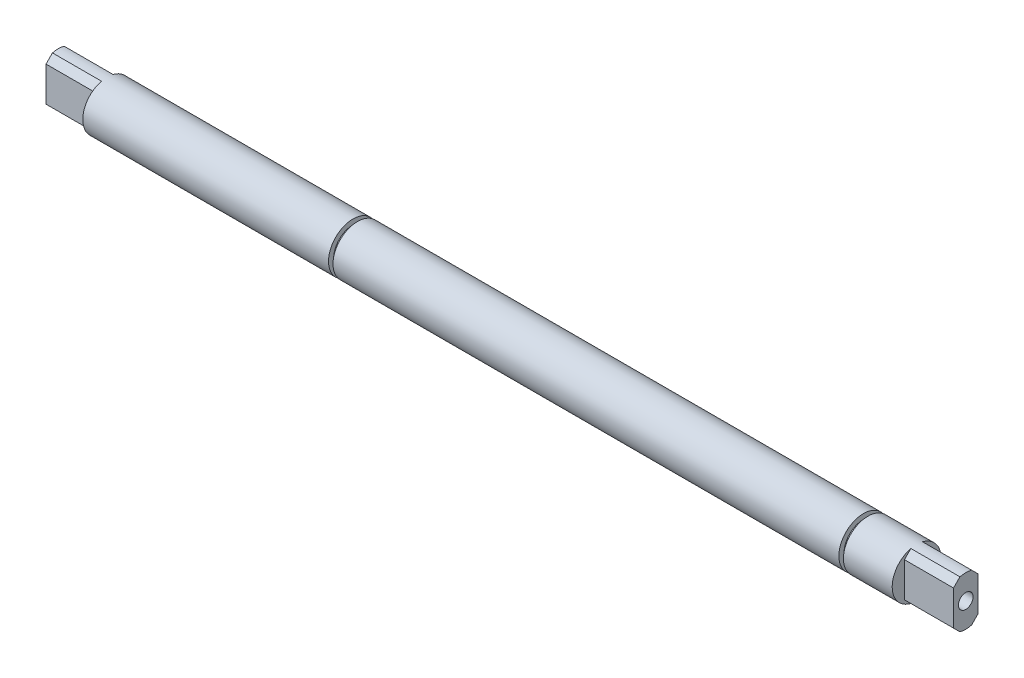
ISO-10303-21;
HEADER;
FILE_DESCRIPTION(('STEP AP214'),'2;1');
FILE_NAME('part.step','',(''),(''),'','','');
FILE_SCHEMA(('AUTOMOTIVE_DESIGN { 1 0 10303 214 1 1 1 1 }'));
ENDSEC;
DATA;
#1=APPLICATION_CONTEXT('core data for automotive mechanical design processes');
#2=APPLICATION_PROTOCOL_DEFINITION('international standard','automotive_design',2000,#1);
#3=PRODUCT_CONTEXT('',#1,'mechanical');
#4=PRODUCT('Part','Part','',(#3));
#5=PRODUCT_RELATED_PRODUCT_CATEGORY('part','',(#4));
#6=PRODUCT_DEFINITION_FORMATION('','',#4);
#7=PRODUCT_DEFINITION_CONTEXT('part definition',#1,'design');
#8=PRODUCT_DEFINITION('design','',#6,#7);
#9=PRODUCT_DEFINITION_SHAPE('','',#8);
#10=(LENGTH_UNIT() NAMED_UNIT(*) SI_UNIT(.MILLI.,.METRE.));
#11=(NAMED_UNIT(*) PLANE_ANGLE_UNIT() SI_UNIT($,.RADIAN.));
#12=(NAMED_UNIT(*) SI_UNIT($,.STERADIAN.) SOLID_ANGLE_UNIT());
#13=UNCERTAINTY_MEASURE_WITH_UNIT(LENGTH_MEASURE(1.E-05),#10,'distance_accuracy_value','');
#14=(GEOMETRIC_REPRESENTATION_CONTEXT(3) GLOBAL_UNCERTAINTY_ASSIGNED_CONTEXT((#13)) GLOBAL_UNIT_ASSIGNED_CONTEXT((#10,
#11,#12)) REPRESENTATION_CONTEXT('',''));
#15=CARTESIAN_POINT('',(0.,0.,0.));
#16=DIRECTION('',(0.,0.,1.));
#17=DIRECTION('',(1.,0.,0.));
#18=AXIS2_PLACEMENT_3D('',#15,#16,#17);
#19=CARTESIAN_POINT('',(117.5,0.,0.));
#20=DIRECTION('',(-1.,0.,0.));
#21=DIRECTION('',(0.,0.,1.));
#22=AXIS2_PLACEMENT_3D('',#19,#20,#21);
#23=CYLINDRICAL_SURFACE('',#22,6.35);
#24=CARTESIAN_POINT('',(-40.,0.,0.));
#25=DIRECTION('',(1.,0.,0.));
#26=DIRECTION('',(0.,0.,-1.));
#27=AXIS2_PLACEMENT_3D('',#24,#25,#26);
#28=CIRCLE('',#27,6.35);
#29=CARTESIAN_POINT('',(-40.,0.,6.35));
#30=VERTEX_POINT('',#29);
#31=EDGE_CURVE('E655',#30,#30,#28,.T.);
#32=CARTESIAN_POINT('',(91.,0.,0.));
#33=DIRECTION('',(1.,0.,0.));
#34=DIRECTION('',(0.,0.,-1.));
#35=AXIS2_PLACEMENT_3D('',#32,#33,#34);
#36=CIRCLE('',#35,6.35);
#37=CARTESIAN_POINT('',(91.,0.,6.35));
#38=VERTEX_POINT('',#37);
#39=EDGE_CURVE('E362',#38,#38,#36,.T.);
#40=CARTESIAN_POINT('',(-40.,0.,6.35));
#41=CARTESIAN_POINT('',(-38.6354166666667,0.,6.35));
#42=CARTESIAN_POINT('',(-37.2708333333333,0.,6.35));
#43=CARTESIAN_POINT('',(-34.5416666666667,0.,6.35));
#44=CARTESIAN_POINT('',(-33.1770833333333,0.,6.35));
#45=CARTESIAN_POINT('',(-30.4479166666667,0.,6.35));
#46=CARTESIAN_POINT('',(-29.0833333333333,0.,6.35));
#47=CARTESIAN_POINT('',(-26.3541666666667,0.,6.35));
#48=CARTESIAN_POINT('',(-24.9895833333333,0.,6.35));
#49=CARTESIAN_POINT('',(-22.2604166666667,0.,6.35));
#50=CARTESIAN_POINT('',(-20.8958333333333,0.,6.35));
#51=CARTESIAN_POINT('',(-18.1666666666667,0.,6.35));
#52=CARTESIAN_POINT('',(-16.8020833333333,0.,6.35));
#53=CARTESIAN_POINT('',(-14.0729166666667,0.,6.35));
#54=CARTESIAN_POINT('',(-12.7083333333333,0.,6.35));
#55=CARTESIAN_POINT('',(-9.97916666666668,0.,6.35));
#56=CARTESIAN_POINT('',(-8.61458333333335,0.,6.35));
#57=CARTESIAN_POINT('',(-5.88541666666668,0.,6.35));
#58=CARTESIAN_POINT('',(-4.52083333333335,0.,6.35));
#59=CARTESIAN_POINT('',(-1.79166666666668,0.,6.35));
#60=CARTESIAN_POINT('',(-0.427083333333351,0.,6.35));
#61=CARTESIAN_POINT('',(2.30208333333331,0.,6.35));
#62=CARTESIAN_POINT('',(3.66666666666664,0.,6.35));
#63=CARTESIAN_POINT('',(6.39583333333331,0.,6.35));
#64=CARTESIAN_POINT('',(7.76041666666664,0.,6.35));
#65=CARTESIAN_POINT('',(10.4895833333333,0.,6.35));
#66=CARTESIAN_POINT('',(11.8541666666667,0.,6.35));
#67=CARTESIAN_POINT('',(14.5833333333333,0.,6.35));
#68=CARTESIAN_POINT('',(15.9479166666666,0.,6.35));
#69=CARTESIAN_POINT('',(18.6770833333333,0.,6.35));
#70=CARTESIAN_POINT('',(20.0416666666666,0.,6.35));
#71=CARTESIAN_POINT('',(22.7708333333333,0.,6.35));
#72=CARTESIAN_POINT('',(24.1354166666666,0.,6.35));
#73=CARTESIAN_POINT('',(26.8645833333333,0.,6.35));
#74=CARTESIAN_POINT('',(28.2291666666667,0.,6.35));
#75=CARTESIAN_POINT('',(30.9583333333333,0.,6.35));
#76=CARTESIAN_POINT('',(32.3229166666667,0.,6.35));
#77=CARTESIAN_POINT('',(35.0520833333333,0.,6.35));
#78=CARTESIAN_POINT('',(36.4166666666666,0.,6.35));
#79=CARTESIAN_POINT('',(39.1458333333333,0.,6.35));
#80=CARTESIAN_POINT('',(40.5104166666666,0.,6.35));
#81=CARTESIAN_POINT('',(43.2395833333333,0.,6.35));
#82=CARTESIAN_POINT('',(44.6041666666667,0.,6.35));
#83=CARTESIAN_POINT('',(47.3333333333333,0.,6.35));
#84=CARTESIAN_POINT('',(48.6979166666667,0.,6.35));
#85=CARTESIAN_POINT('',(51.4270833333333,0.,6.35));
#86=CARTESIAN_POINT('',(52.7916666666666,0.,6.35));
#87=CARTESIAN_POINT('',(55.5208333333333,0.,6.35));
#88=CARTESIAN_POINT('',(56.8854166666666,0.,6.35));
#89=CARTESIAN_POINT('',(59.6145833333333,0.,6.35));
#90=CARTESIAN_POINT('',(60.9791666666667,0.,6.35));
#91=CARTESIAN_POINT('',(63.7083333333333,0.,6.35));
#92=CARTESIAN_POINT('',(65.0729166666666,0.,6.35));
#93=CARTESIAN_POINT('',(67.8020833333333,0.,6.35));
#94=CARTESIAN_POINT('',(69.1666666666666,0.,6.35));
#95=CARTESIAN_POINT('',(71.8958333333333,0.,6.35));
#96=CARTESIAN_POINT('',(73.2604166666666,0.,6.35));
#97=CARTESIAN_POINT('',(75.9895833333333,0.,6.35));
#98=CARTESIAN_POINT('',(77.3541666666666,0.,6.35));
#99=CARTESIAN_POINT('',(80.0833333333333,0.,6.35));
#100=CARTESIAN_POINT('',(81.4479166666666,0.,6.35));
#101=CARTESIAN_POINT('',(84.1770833333333,0.,6.35));
#102=CARTESIAN_POINT('',(85.5416666666666,0.,6.35));
#103=CARTESIAN_POINT('',(88.2708333333333,0.,6.35));
#104=CARTESIAN_POINT('',(89.6354166666666,0.,6.35));
#105=CARTESIAN_POINT('',(91.,0.,6.35));
#106=B_SPLINE_CURVE_WITH_KNOTS('',3,(#40,#41,#42,#43,#44,#45,#46,#47,#48,#49,#50,#51,#52,#53,
#54,#55,#56,#57,#58,#59,#60,#61,#62,#63,#64,#65,#66,#67,#68,#69,#70,#71,#72,#73,#74,#75,#76,#77,
#78,#79,#80,#81,#82,#83,#84,#85,#86,#87,#88,#89,#90,#91,#92,#93,#94,#95,#96,#97,#98,#99,#100,
#101,#102,#103,#104,#105),.UNSPECIFIED.,.F.,.F.,(4,2,2,2,2,2,2,2,2,2,2,2,2,2,2,2,2,2,2,2,2,2,2,
2,2,2,2,2,2,2,2,2,4),(0.,4.09375000000001,8.18750000000001,12.28125,16.375,20.46875,24.5625,
28.65625,32.75,36.84375,40.9375,45.03125,49.125,53.21875,57.3125,61.40625,65.5,69.59375,73.6875,
77.78125,81.875,85.96875,90.0625,94.15625,98.25,102.34375,106.4375,110.53125,114.625,118.71875,
122.8125,126.90625,131.),.UNSPECIFIED.);
#107=EDGE_CURVE('BSEAM36',#30,#38,#106,.T.);
#108=ORIENTED_EDGE('',*,*,#31,.T.);
#109=ORIENTED_EDGE('',*,*,#39,.F.);
#110=ORIENTED_EDGE('',*,*,#107,.T.);
#111=ORIENTED_EDGE('',*,*,#107,.F.);
#112=EDGE_LOOP('',(#108,#110,#109,#111));
#113=FACE_BOUND('',#112,.T.);
#114=ADVANCED_FACE('F36',(#113),#23,.T.);
#115=CARTESIAN_POINT('',(91.,0.,-6.35));
#116=DIRECTION('',(-1.,0.,0.));
#117=DIRECTION('',(0.,0.,1.));
#118=AXIS2_PLACEMENT_3D('',#115,#116,#117);
#119=PLANE('',#118);
#120=CARTESIAN_POINT('',(91.,0.,0.));
#121=DIRECTION('',(1.,0.,0.));
#122=DIRECTION('',(0.,0.,-1.));
#123=AXIS2_PLACEMENT_3D('',#120,#121,#122);
#124=CIRCLE('',#123,5.0292);
#125=CARTESIAN_POINT('',(91.,0.,-5.0292));
#126=VERTEX_POINT('',#125);
#127=EDGE_CURVE('E169',#126,#126,#124,.T.);
#128=ORIENTED_EDGE('',*,*,#127,.F.);
#129=EDGE_LOOP('',(#128));
#130=FACE_BOUND('',#129,.T.);
#131=ORIENTED_EDGE('',*,*,#39,.T.);
#132=EDGE_LOOP('',(#131));
#133=FACE_BOUND('',#132,.T.);
#134=ADVANCED_FACE('F329',(#130,#133),#119,.F.);
#135=CARTESIAN_POINT('',(0.,0.,0.));
#136=DIRECTION('',(1.,0.,0.));
#137=DIRECTION('',(0.,0.,-1.));
#138=AXIS2_PLACEMENT_3D('',#135,#136,#137);
#139=CYLINDRICAL_SURFACE('',#138,5.0292);
#140=CARTESIAN_POINT('',(92.1684,0.,0.));
#141=DIRECTION('',(1.,0.,0.));
#142=DIRECTION('',(0.,0.,-1.));
#143=AXIS2_PLACEMENT_3D('',#140,#141,#142);
#144=CIRCLE('',#143,5.0292);
#145=CARTESIAN_POINT('',(92.1684,0.,-5.0292));
#146=VERTEX_POINT('',#145);
#147=EDGE_CURVE('E361',#146,#146,#144,.T.);
#148=ORIENTED_EDGE('',*,*,#147,.F.);
#149=EDGE_LOOP('',(#148));
#150=FACE_BOUND('',#149,.T.);
#151=ORIENTED_EDGE('',*,*,#127,.T.);
#152=EDGE_LOOP('',(#151));
#153=FACE_BOUND('',#152,.T.);
#154=ADVANCED_FACE('F336',(#150,#153),#139,.T.);
#155=CARTESIAN_POINT('',(92.1684,0.,-5.0292));
#156=DIRECTION('',(1.,0.,0.));
#157=DIRECTION('',(0.,0.,-1.));
#158=AXIS2_PLACEMENT_3D('',#155,#156,#157);
#159=PLANE('',#158);
#160=CARTESIAN_POINT('',(92.1684,0.,0.));
#161=DIRECTION('',(1.,0.,0.));
#162=DIRECTION('',(0.,0.,-1.));
#163=AXIS2_PLACEMENT_3D('',#160,#161,#162);
#164=CIRCLE('',#163,6.35);
#165=CARTESIAN_POINT('',(92.1684,0.,-6.35));
#166=VERTEX_POINT('',#165);
#167=EDGE_CURVE('E359',#166,#166,#164,.T.);
#168=ORIENTED_EDGE('',*,*,#167,.F.);
#169=EDGE_LOOP('',(#168));
#170=FACE_BOUND('',#169,.T.);
#171=ORIENTED_EDGE('',*,*,#147,.T.);
#172=EDGE_LOOP('',(#171));
#173=FACE_BOUND('',#172,.T.);
#174=ADVANCED_FACE('F156',(#170,#173),#159,.F.);
#175=CARTESIAN_POINT('',(102.55,0.,0.));
#176=DIRECTION('',(1.,0.,0.));
#177=DIRECTION('',(0.,0.,-1.));
#178=AXIS2_PLACEMENT_3D('',#175,#176,#177);
#179=CONICAL_SURFACE('',#178,1.89864999999999,1.02974425867665);
#180=CARTESIAN_POINT('',(101.409175985683,0.,0.));
#181=VERTEX_POINT('',#180);
#182=VERTEX_LOOP('',#181);
#183=FACE_BOUND('',#182,.T.);
#184=CARTESIAN_POINT('',(102.55,0.,0.));
#185=DIRECTION('',(1.,0.,0.));
#186=DIRECTION('',(0.,0.,-1.));
#187=AXIS2_PLACEMENT_3D('',#184,#185,#186);
#188=CIRCLE('',#187,1.89864999999999);
#189=CARTESIAN_POINT('',(102.55,0.,-1.89864999999999));
#190=VERTEX_POINT('',#189);
#191=EDGE_CURVE('E160',#190,#190,#188,.T.);
#192=ORIENTED_EDGE('',*,*,#191,.T.);
#193=EDGE_LOOP('',(#192));
#194=FACE_BOUND('',#193,.T.);
#195=ADVANCED_FACE('F152',(#183,#194),#179,.F.);
#196=CARTESIAN_POINT('',(104.8,5.49926131403118,-3.175));
#197=DIRECTION('',(0.,0.,-1.));
#198=DIRECTION('',(-1.,0.,0.));
#199=AXIS2_PLACEMENT_3D('',#196,#197,#198);
#200=PLANE('',#199);
#201=DIRECTION('',(0.,1.,0.));
#202=VECTOR('',#201,1.);
#203=CARTESIAN_POINT('',(117.5,5.49926131403118,-3.175));
#204=LINE('',#203,#202);
#205=CARTESIAN_POINT('',(117.5,-4.49926131403115,-3.175));
#206=VERTEX_POINT('',#205);
#207=CARTESIAN_POINT('',(117.5,4.49926131403114,-3.175));
#208=VERTEX_POINT('',#207);
#209=EDGE_CURVE('E181',#206,#208,#204,.T.);
#210=ORIENTED_EDGE('',*,*,#209,.F.);
#211=DIRECTION('',(-1.,0.,0.));
#212=VECTOR('',#211,1.);
#213=CARTESIAN_POINT('',(104.8,-4.49926131403114,-3.175));
#214=LINE('',#213,#212);
#215=CARTESIAN_POINT('',(104.8,-4.49926131403114,-3.175));
#216=VERTEX_POINT('',#215);
#217=EDGE_CURVE('E56',#206,#216,#214,.T.);
#218=ORIENTED_EDGE('',*,*,#217,.T.);
#219=DIRECTION('',(0.,1.,0.));
#220=VECTOR('',#219,1.);
#221=CARTESIAN_POINT('',(104.8,5.49926131403118,-3.175));
#222=LINE('',#221,#220);
#223=CARTESIAN_POINT('',(104.8,4.49926131403114,-3.175));
#224=VERTEX_POINT('',#223);
#225=EDGE_CURVE('E186',#216,#224,#222,.T.);
#226=ORIENTED_EDGE('',*,*,#225,.T.);
#227=DIRECTION('',(1.,0.,0.));
#228=VECTOR('',#227,1.);
#229=CARTESIAN_POINT('',(117.5,4.49926131403114,-3.175));
#230=LINE('',#229,#228);
#231=EDGE_CURVE('E279',#224,#208,#230,.T.);
#232=ORIENTED_EDGE('',*,*,#231,.T.);
#233=EDGE_LOOP('',(#210,#218,#226,#232));
#234=FACE_BOUND('',#233,.T.);
#235=ADVANCED_FACE('F155',(#234),#200,.T.);
#236=CARTESIAN_POINT('',(117.5,0.,0.));
#237=DIRECTION('',(1.,0.,0.));
#238=DIRECTION('',(0.,0.,-1.));
#239=AXIS2_PLACEMENT_3D('',#236,#237,#238);
#240=CYLINDRICAL_SURFACE('',#239,1.89864999999999);
#241=ORIENTED_EDGE('',*,*,#191,.F.);
#242=EDGE_LOOP('',(#241));
#243=FACE_BOUND('',#242,.T.);
#244=CARTESIAN_POINT('',(117.5,0.,0.));
#245=DIRECTION('',(1.,0.,0.));
#246=DIRECTION('',(0.,0.,-1.));
#247=AXIS2_PLACEMENT_3D('',#244,#245,#246);
#248=CIRCLE('',#247,1.89864999999999);
#249=CARTESIAN_POINT('',(117.5,0.,-1.89864999999999));
#250=VERTEX_POINT('',#249);
#251=EDGE_CURVE('E163',#250,#250,#248,.T.);
#252=ORIENTED_EDGE('',*,*,#251,.T.);
#253=EDGE_LOOP('',(#252));
#254=FACE_BOUND('',#253,.T.);
#255=ADVANCED_FACE('F320',(#243,#254),#240,.F.);
#256=CARTESIAN_POINT('',(104.8,5.49926131403118,3.175));
#257=DIRECTION('',(0.,0.,1.));
#258=DIRECTION('',(1.,0.,0.));
#259=AXIS2_PLACEMENT_3D('',#256,#257,#258);
#260=PLANE('',#259);
#261=DIRECTION('',(0.,-1.,0.));
#262=VECTOR('',#261,1.);
#263=CARTESIAN_POINT('',(117.5,5.49926131403118,3.175));
#264=LINE('',#263,#262);
#265=CARTESIAN_POINT('',(117.5,4.49926131403115,3.175));
#266=VERTEX_POINT('',#265);
#267=CARTESIAN_POINT('',(117.5,-4.49926131403114,3.175));
#268=VERTEX_POINT('',#267);
#269=EDGE_CURVE('E175',#266,#268,#264,.T.);
#270=ORIENTED_EDGE('',*,*,#269,.F.);
#271=DIRECTION('',(-1.,0.,0.));
#272=VECTOR('',#271,1.);
#273=CARTESIAN_POINT('',(104.8,4.49926131403114,3.175));
#274=LINE('',#273,#272);
#275=CARTESIAN_POINT('',(104.8,4.49926131403114,3.175));
#276=VERTEX_POINT('',#275);
#277=EDGE_CURVE('E277',#266,#276,#274,.T.);
#278=ORIENTED_EDGE('',*,*,#277,.T.);
#279=DIRECTION('',(0.,-1.,0.));
#280=VECTOR('',#279,1.);
#281=CARTESIAN_POINT('',(104.8,5.49926131403118,3.175));
#282=LINE('',#281,#280);
#283=CARTESIAN_POINT('',(104.8,-4.49926131403114,3.175));
#284=VERTEX_POINT('',#283);
#285=EDGE_CURVE('E178',#276,#284,#282,.T.);
#286=ORIENTED_EDGE('',*,*,#285,.T.);
#287=DIRECTION('',(1.,0.,0.));
#288=VECTOR('',#287,1.);
#289=CARTESIAN_POINT('',(117.5,-4.49926131403114,3.175));
#290=LINE('',#289,#288);
#291=EDGE_CURVE('E274',#284,#268,#290,.T.);
#292=ORIENTED_EDGE('',*,*,#291,.T.);
#293=EDGE_LOOP('',(#270,#278,#286,#292));
#294=FACE_BOUND('',#293,.T.);
#295=ADVANCED_FACE('F306',(#294),#260,.T.);
#296=CARTESIAN_POINT('',(117.5,-4.49926131403114,3.175));
#297=DIRECTION('',(0.,-0.707106781186553,0.707106781186542));
#298=DIRECTION('',(-1.,0.,0.));
#299=AXIS2_PLACEMENT_3D('',#296,#297,#298);
#300=PLANE('',#299);
#301=DIRECTION('',(0.,0.707106781186542,0.707106781186553));
#302=VECTOR('',#301,1.);
#303=CARTESIAN_POINT('',(104.8,-4.49926131403114,3.175));
#304=LINE('',#303,#302);
#305=CARTESIAN_POINT('',(104.8,-6.16901365600829,1.50524765802282));
#306=VERTEX_POINT('',#305);
#307=EDGE_CURVE('E286',#306,#284,#304,.T.);
#308=ORIENTED_EDGE('',*,*,#307,.F.);
#309=DIRECTION('',(-1.,0.,0.));
#310=VECTOR('',#309,1.);
#311=CARTESIAN_POINT('',(117.5,-6.16901365600829,1.50524765802282));
#312=LINE('',#311,#310);
#313=CARTESIAN_POINT('',(117.5,-6.16901365600829,1.50524765802282));
#314=VERTEX_POINT('',#313);
#315=EDGE_CURVE('E260',#314,#306,#312,.T.);
#316=ORIENTED_EDGE('',*,*,#315,.F.);
#317=DIRECTION('',(0.,-0.707106781186542,-0.707106781186553));
#318=VECTOR('',#317,1.);
#319=CARTESIAN_POINT('',(117.5,-3.8371306570156,3.83713065701555));
#320=LINE('',#319,#318);
#321=EDGE_CURVE('E270',#268,#314,#320,.T.);
#322=ORIENTED_EDGE('',*,*,#321,.F.);
#323=ORIENTED_EDGE('',*,*,#291,.F.);
#324=EDGE_LOOP('',(#308,#316,#322,#323));
#325=FACE_BOUND('',#324,.T.);
#326=ADVANCED_FACE('F304',(#325),#300,.T.);
#327=CARTESIAN_POINT('',(117.5,-6.16901365600829,-1.50524765802282));
#328=DIRECTION('',(0.,-0.707106781186553,-0.707106781186542));
#329=DIRECTION('',(-1.,0.,0.));
#330=AXIS2_PLACEMENT_3D('',#327,#328,#329);
#331=PLANE('',#330);
#332=DIRECTION('',(0.,-0.707106781186542,0.707106781186553));
#333=VECTOR('',#332,1.);
#334=CARTESIAN_POINT('',(104.8,-6.16901365600829,-1.50524765802282));
#335=LINE('',#334,#333);
#336=CARTESIAN_POINT('',(104.8,-6.16901365600829,-1.50524765802282));
#337=VERTEX_POINT('',#336);
#338=EDGE_CURVE('E44',#216,#337,#335,.T.);
#339=ORIENTED_EDGE('',*,*,#338,.F.);
#340=ORIENTED_EDGE('',*,*,#217,.F.);
#341=DIRECTION('',(0.,0.707106781186542,-0.707106781186553));
#342=VECTOR('',#341,1.);
#343=CARTESIAN_POINT('',(117.5,-3.83713065701561,-3.83713065701555));
#344=LINE('',#343,#342);
#345=CARTESIAN_POINT('',(117.5,-6.16901365600829,-1.50524765802282));
#346=VERTEX_POINT('',#345);
#347=EDGE_CURVE('E268',#346,#206,#344,.T.);
#348=ORIENTED_EDGE('',*,*,#347,.F.);
#349=DIRECTION('',(-1.,0.,0.));
#350=VECTOR('',#349,1.);
#351=CARTESIAN_POINT('',(117.5,-6.16901365600829,-1.50524765802282));
#352=LINE('',#351,#350);
#353=EDGE_CURVE('E257',#337,#346,#352,.F.);
#354=ORIENTED_EDGE('',*,*,#353,.F.);
#355=EDGE_LOOP('',(#339,#340,#348,#354));
#356=FACE_BOUND('',#355,.T.);
#357=ADVANCED_FACE('F292',(#356),#331,.T.);
#358=CARTESIAN_POINT('',(104.8,0.,0.));
#359=DIRECTION('',(1.,0.,0.));
#360=DIRECTION('',(0.,0.,1.));
#361=AXIS2_PLACEMENT_3D('',#358,#359,#360);
#362=PLANE('',#361);
#363=CARTESIAN_POINT('',(104.8,0.,0.));
#364=DIRECTION('',(-1.,0.,0.));
#365=DIRECTION('',(0.,0.,1.));
#366=AXIS2_PLACEMENT_3D('',#363,#364,#365);
#367=CIRCLE('',#366,6.35);
#368=CARTESIAN_POINT('',(104.8,6.16901365600829,-1.50524765802282));
#369=VERTEX_POINT('',#368);
#370=EDGE_CURVE('E184',#369,#337,#367,.T.);
#371=ORIENTED_EDGE('',*,*,#370,.F.);
#372=DIRECTION('',(0.,-0.707106781186543,-0.707106781186552));
#373=VECTOR('',#372,1.);
#374=CARTESIAN_POINT('',(104.8,4.49926131403114,-3.175));
#375=LINE('',#374,#373);
#376=EDGE_CURVE('E11',#369,#224,#375,.T.);
#377=ORIENTED_EDGE('',*,*,#376,.T.);
#378=ORIENTED_EDGE('',*,*,#225,.F.);
#379=ORIENTED_EDGE('',*,*,#338,.T.);
#380=EDGE_LOOP('',(#371,#377,#378,#379));
#381=FACE_BOUND('',#380,.T.);
#382=ADVANCED_FACE('F290',(#381),#362,.T.);
#383=CARTESIAN_POINT('',(117.5,4.49926131403114,-3.175));
#384=DIRECTION('',(0.,0.707106781186552,-0.707106781186543));
#385=DIRECTION('',(-1.,0.,0.));
#386=AXIS2_PLACEMENT_3D('',#383,#384,#385);
#387=PLANE('',#386);
#388=ORIENTED_EDGE('',*,*,#376,.F.);
#389=DIRECTION('',(-1.,0.,0.));
#390=VECTOR('',#389,1.);
#391=CARTESIAN_POINT('',(117.5,6.16901365600829,-1.50524765802282));
#392=LINE('',#391,#390);
#393=CARTESIAN_POINT('',(117.5,6.16901365600829,-1.50524765802282));
#394=VERTEX_POINT('',#393);
#395=EDGE_CURVE('E254',#394,#369,#392,.T.);
#396=ORIENTED_EDGE('',*,*,#395,.F.);
#397=DIRECTION('',(0.,0.707106781186543,0.707106781186552));
#398=VECTOR('',#397,1.);
#399=CARTESIAN_POINT('',(117.5,3.8371306570156,-3.83713065701555));
#400=LINE('',#399,#398);
#401=EDGE_CURVE('E266',#208,#394,#400,.T.);
#402=ORIENTED_EDGE('',*,*,#401,.F.);
#403=ORIENTED_EDGE('',*,*,#231,.F.);
#404=EDGE_LOOP('',(#388,#396,#402,#403));
#405=FACE_BOUND('',#404,.T.);
#406=ADVANCED_FACE('F38',(#405),#387,.T.);
#407=CARTESIAN_POINT('',(117.5,0.,0.));
#408=DIRECTION('',(1.,0.,0.));
#409=DIRECTION('',(0.,0.,-1.));
#410=AXIS2_PLACEMENT_3D('',#407,#408,#409);
#411=PLANE('',#410);
#412=ORIENTED_EDGE('',*,*,#251,.F.);
#413=EDGE_LOOP('',(#412));
#414=FACE_BOUND('',#413,.T.);
#415=CARTESIAN_POINT('',(117.5,0.,0.));
#416=DIRECTION('',(1.,0.,0.));
#417=DIRECTION('',(0.,0.,-1.));
#418=AXIS2_PLACEMENT_3D('',#415,#416,#417);
#419=CIRCLE('',#418,6.35);
#420=CARTESIAN_POINT('',(117.5,6.16901365600829,1.50524765802282));
#421=VERTEX_POINT('',#420);
#422=EDGE_CURVE('E210',#394,#421,#419,.T.);
#423=ORIENTED_EDGE('',*,*,#422,.T.);
#424=DIRECTION('',(0.,-0.707106781186543,0.707106781186552));
#425=VECTOR('',#424,1.);
#426=CARTESIAN_POINT('',(117.5,3.8371306570156,3.83713065701555));
#427=LINE('',#426,#425);
#428=EDGE_CURVE('E272',#421,#266,#427,.T.);
#429=ORIENTED_EDGE('',*,*,#428,.T.);
#430=ORIENTED_EDGE('',*,*,#269,.T.);
#431=ORIENTED_EDGE('',*,*,#321,.T.);
#432=EDGE_CURVE('E207',#314,#346,#419,.T.);
#433=ORIENTED_EDGE('',*,*,#432,.T.);
#434=ORIENTED_EDGE('',*,*,#347,.T.);
#435=ORIENTED_EDGE('',*,*,#209,.T.);
#436=ORIENTED_EDGE('',*,*,#401,.T.);
#437=EDGE_LOOP('',(#423,#429,#430,#431,#433,#434,#435,#436));
#438=FACE_BOUND('',#437,.T.);
#439=ADVANCED_FACE('F299',(#414,#438),#411,.T.);
#440=CARTESIAN_POINT('',(117.5,6.16901365600829,1.50524765802283));
#441=DIRECTION('',(0.,0.707106781186552,0.707106781186543));
#442=DIRECTION('',(-1.,0.,0.));
#443=AXIS2_PLACEMENT_3D('',#440,#441,#442);
#444=PLANE('',#443);
#445=DIRECTION('',(0.,0.707106781186543,-0.707106781186552));
#446=VECTOR('',#445,1.);
#447=CARTESIAN_POINT('',(104.8,6.16901365600829,1.50524765802283));
#448=LINE('',#447,#446);
#449=CARTESIAN_POINT('',(104.8,6.16901365600829,1.50524765802282));
#450=VERTEX_POINT('',#449);
#451=EDGE_CURVE('E283',#276,#450,#448,.T.);
#452=ORIENTED_EDGE('',*,*,#451,.F.);
#453=ORIENTED_EDGE('',*,*,#277,.F.);
#454=ORIENTED_EDGE('',*,*,#428,.F.);
#455=DIRECTION('',(-1.,0.,0.));
#456=VECTOR('',#455,1.);
#457=CARTESIAN_POINT('',(117.5,6.16901365600829,1.50524765802283));
#458=LINE('',#457,#456);
#459=EDGE_CURVE('E263',#450,#421,#458,.F.);
#460=ORIENTED_EDGE('',*,*,#459,.F.);
#461=EDGE_LOOP('',(#452,#453,#454,#460));
#462=FACE_BOUND('',#461,.T.);
#463=ADVANCED_FACE('F314',(#462),#444,.T.);
#464=CARTESIAN_POINT('',(104.8,0.,0.));
#465=DIRECTION('',(1.,0.,0.));
#466=DIRECTION('',(0.,0.,1.));
#467=AXIS2_PLACEMENT_3D('',#464,#465,#466);
#468=PLANE('',#467);
#469=CARTESIAN_POINT('',(104.8,0.,0.));
#470=DIRECTION('',(-1.,0.,0.));
#471=DIRECTION('',(0.,0.,1.));
#472=AXIS2_PLACEMENT_3D('',#469,#470,#471);
#473=CIRCLE('',#472,6.35);
#474=EDGE_CURVE('E176',#306,#450,#473,.T.);
#475=ORIENTED_EDGE('',*,*,#474,.F.);
#476=ORIENTED_EDGE('',*,*,#307,.T.);
#477=ORIENTED_EDGE('',*,*,#285,.F.);
#478=ORIENTED_EDGE('',*,*,#451,.T.);
#479=EDGE_LOOP('',(#475,#476,#477,#478));
#480=FACE_BOUND('',#479,.T.);
#481=ADVANCED_FACE('F311',(#480),#468,.T.);
#482=ORIENTED_EDGE('',*,*,#167,.T.);
#483=EDGE_LOOP('',(#482));
#484=FACE_BOUND('',#483,.T.);
#485=ORIENTED_EDGE('',*,*,#474,.T.);
#486=ORIENTED_EDGE('',*,*,#459,.T.);
#487=ORIENTED_EDGE('',*,*,#422,.F.);
#488=ORIENTED_EDGE('',*,*,#395,.T.);
#489=ORIENTED_EDGE('',*,*,#370,.T.);
#490=ORIENTED_EDGE('',*,*,#353,.T.);
#491=ORIENTED_EDGE('',*,*,#432,.F.);
#492=ORIENTED_EDGE('',*,*,#315,.T.);
#493=EDGE_LOOP('',(#485,#486,#487,#488,#489,#490,#491,#492));
#494=FACE_BOUND('',#493,.T.);
#495=ADVANCED_FACE('F295',(#484,#494),#23,.T.);
#496=CARTESIAN_POINT('',(-40.,0.,-6.35));
#497=DIRECTION('',(1.,0.,0.));
#498=DIRECTION('',(0.,0.,-1.));
#499=AXIS2_PLACEMENT_3D('',#496,#497,#498);
#500=PLANE('',#499);
#501=ORIENTED_EDGE('',*,*,#31,.F.);
#502=EDGE_LOOP('',(#501));
#503=FACE_BOUND('',#502,.T.);
#504=CARTESIAN_POINT('',(-40.,0.,0.));
#505=DIRECTION('',(1.,0.,0.));
#506=DIRECTION('',(0.,0.,-1.));
#507=AXIS2_PLACEMENT_3D('',#504,#505,#506);
#508=CIRCLE('',#507,5.0292);
#509=CARTESIAN_POINT('',(-40.,0.,-5.0292));
#510=VERTEX_POINT('',#509);
#511=EDGE_CURVE('E367',#510,#510,#508,.T.);
#512=ORIENTED_EDGE('',*,*,#511,.T.);
#513=EDGE_LOOP('',(#512));
#514=FACE_BOUND('',#513,.T.);
#515=ADVANCED_FACE('F347',(#503,#514),#500,.F.);
#516=CARTESIAN_POINT('',(0.,0.,0.));
#517=DIRECTION('',(1.,0.,0.));
#518=DIRECTION('',(0.,0.,-1.));
#519=AXIS2_PLACEMENT_3D('',#516,#517,#518);
#520=CYLINDRICAL_SURFACE('',#519,5.0292);
#521=ORIENTED_EDGE('',*,*,#511,.F.);
#522=EDGE_LOOP('',(#521));
#523=FACE_BOUND('',#522,.T.);
#524=CARTESIAN_POINT('',(-41.1684,0.,0.));
#525=DIRECTION('',(1.,0.,0.));
#526=DIRECTION('',(0.,0.,-1.));
#527=AXIS2_PLACEMENT_3D('',#524,#525,#526);
#528=CIRCLE('',#527,5.0292);
#529=CARTESIAN_POINT('',(-41.1684,0.,-5.0292));
#530=VERTEX_POINT('',#529);
#531=EDGE_CURVE('E651',#530,#530,#528,.T.);
#532=ORIENTED_EDGE('',*,*,#531,.T.);
#533=EDGE_LOOP('',(#532));
#534=FACE_BOUND('',#533,.T.);
#535=ADVANCED_FACE('F353',(#523,#534),#520,.T.);
#536=CARTESIAN_POINT('',(-41.1684,0.,-6.35));
#537=DIRECTION('',(-1.,0.,0.));
#538=DIRECTION('',(0.,0.,1.));
#539=AXIS2_PLACEMENT_3D('',#536,#537,#538);
#540=PLANE('',#539);
#541=ORIENTED_EDGE('',*,*,#531,.F.);
#542=EDGE_LOOP('',(#541));
#543=FACE_BOUND('',#542,.T.);
#544=CARTESIAN_POINT('',(-41.1684,0.,0.));
#545=DIRECTION('',(1.,0.,0.));
#546=DIRECTION('',(0.,0.,-1.));
#547=AXIS2_PLACEMENT_3D('',#544,#545,#546);
#548=CIRCLE('',#547,6.35);
#549=CARTESIAN_POINT('',(-41.1684,0.,-6.35));
#550=VERTEX_POINT('',#549);
#551=EDGE_CURVE('E654',#550,#550,#548,.T.);
#552=ORIENTED_EDGE('',*,*,#551,.T.);
#553=EDGE_LOOP('',(#552));
#554=FACE_BOUND('',#553,.T.);
#555=ADVANCED_FACE('F393',(#543,#554),#540,.F.);
#556=CARTESIAN_POINT('',(-102.55,0.,0.));
#557=DIRECTION('',(-1.,0.,0.));
#558=DIRECTION('',(0.,0.,1.));
#559=AXIS2_PLACEMENT_3D('',#556,#557,#558);
#560=CONICAL_SURFACE('',#559,1.89864999999999,1.02974425867665);
#561=CARTESIAN_POINT('',(-101.409175985683,0.,0.));
#562=VERTEX_POINT('',#561);
#563=VERTEX_LOOP('',#562);
#564=FACE_BOUND('',#563,.T.);
#565=CARTESIAN_POINT('',(-102.55,0.,0.));
#566=DIRECTION('',(-1.,0.,0.));
#567=DIRECTION('',(0.,0.,1.));
#568=AXIS2_PLACEMENT_3D('',#565,#566,#567);
#569=CIRCLE('',#568,1.89864999999999);
#570=CARTESIAN_POINT('',(-102.55,0.,1.89864999999999));
#571=VERTEX_POINT('',#570);
#572=EDGE_CURVE('E166',#571,#571,#569,.T.);
#573=ORIENTED_EDGE('',*,*,#572,.T.);
#574=EDGE_LOOP('',(#573));
#575=FACE_BOUND('',#574,.T.);
#576=ADVANCED_FACE('F390',(#564,#575),#560,.F.);
#577=CARTESIAN_POINT('',(-104.8,5.49926131403118,3.175));
#578=DIRECTION('',(0.,0.,-1.));
#579=DIRECTION('',(-1.,0.,0.));
#580=AXIS2_PLACEMENT_3D('',#577,#578,#579);
#581=PLANE('',#580);
#582=DIRECTION('',(0.,-1.,0.));
#583=VECTOR('',#582,1.);
#584=CARTESIAN_POINT('',(-117.5,5.49926131403118,3.175));
#585=LINE('',#584,#583);
#586=CARTESIAN_POINT('',(-117.5,4.49926131403114,3.175));
#587=VERTEX_POINT('',#586);
#588=CARTESIAN_POINT('',(-117.5,-4.49926131403103,3.175));
#589=VERTEX_POINT('',#588);
#590=EDGE_CURVE('E188',#587,#589,#585,.T.);
#591=ORIENTED_EDGE('',*,*,#590,.T.);
#592=DIRECTION('',(1.,0.,0.));
#593=VECTOR('',#592,1.);
#594=CARTESIAN_POINT('',(-104.8,-4.49926131403114,3.175));
#595=LINE('',#594,#593);
#596=CARTESIAN_POINT('',(-104.8,-4.49926131403114,3.175));
#597=VERTEX_POINT('',#596);
#598=EDGE_CURVE('E242',#589,#597,#595,.T.);
#599=ORIENTED_EDGE('',*,*,#598,.T.);
#600=DIRECTION('',(0.,-1.,0.));
#601=VECTOR('',#600,1.);
#602=CARTESIAN_POINT('',(-104.8,5.49926131403118,3.175));
#603=LINE('',#602,#601);
#604=CARTESIAN_POINT('',(-104.8,4.49926131403126,3.175));
#605=VERTEX_POINT('',#604);
#606=EDGE_CURVE('E193',#605,#597,#603,.T.);
#607=ORIENTED_EDGE('',*,*,#606,.F.);
#608=DIRECTION('',(-1.,0.,0.));
#609=VECTOR('',#608,1.);
#610=CARTESIAN_POINT('',(-104.8,4.49926131403126,3.175));
#611=LINE('',#610,#609);
#612=EDGE_CURVE('E239',#605,#587,#611,.T.);
#613=ORIENTED_EDGE('',*,*,#612,.T.);
#614=EDGE_LOOP('',(#591,#599,#607,#613));
#615=FACE_BOUND('',#614,.T.);
#616=ADVANCED_FACE('F392',(#615),#581,.F.);
#617=CARTESIAN_POINT('',(-104.8,5.49926131403118,-3.175));
#618=DIRECTION('',(0.,0.,1.));
#619=DIRECTION('',(1.,0.,0.));
#620=AXIS2_PLACEMENT_3D('',#617,#618,#619);
#621=PLANE('',#620);
#622=DIRECTION('',(0.,1.,0.));
#623=VECTOR('',#622,1.);
#624=CARTESIAN_POINT('',(-104.8,5.49926131403118,-3.175));
#625=LINE('',#624,#623);
#626=CARTESIAN_POINT('',(-104.8,-4.49926131403126,-3.175));
#627=VERTEX_POINT('',#626);
#628=CARTESIAN_POINT('',(-104.8,4.49926131403114,-3.175));
#629=VERTEX_POINT('',#628);
#630=EDGE_CURVE('E201',#627,#629,#625,.T.);
#631=ORIENTED_EDGE('',*,*,#630,.F.);
#632=DIRECTION('',(-1.,0.,0.));
#633=VECTOR('',#632,1.);
#634=CARTESIAN_POINT('',(-104.8,-4.49926131403126,-3.175));
#635=LINE('',#634,#633);
#636=CARTESIAN_POINT('',(-117.5,-4.49926131403114,-3.175));
#637=VERTEX_POINT('',#636);
#638=EDGE_CURVE('E216',#627,#637,#635,.T.);
#639=ORIENTED_EDGE('',*,*,#638,.T.);
#640=DIRECTION('',(0.,1.,0.));
#641=VECTOR('',#640,1.);
#642=CARTESIAN_POINT('',(-117.5,5.49926131403118,-3.175));
#643=LINE('',#642,#641);
#644=CARTESIAN_POINT('',(-117.5,4.49926131403103,-3.175));
#645=VERTEX_POINT('',#644);
#646=EDGE_CURVE('E196',#637,#645,#643,.T.);
#647=ORIENTED_EDGE('',*,*,#646,.T.);
#648=DIRECTION('',(1.,0.,0.));
#649=VECTOR('',#648,1.);
#650=CARTESIAN_POINT('',(-104.8,4.49926131403114,-3.175));
#651=LINE('',#650,#649);
#652=EDGE_CURVE('E214',#645,#629,#651,.T.);
#653=ORIENTED_EDGE('',*,*,#652,.T.);
#654=EDGE_LOOP('',(#631,#639,#647,#653));
#655=FACE_BOUND('',#654,.T.);
#656=ADVANCED_FACE('F388',(#655),#621,.F.);
#657=CARTESIAN_POINT('',(-117.5,0.,0.));
#658=DIRECTION('',(-1.,0.,0.));
#659=DIRECTION('',(0.,0.,1.));
#660=AXIS2_PLACEMENT_3D('',#657,#658,#659);
#661=CYLINDRICAL_SURFACE('',#660,1.89864999999999);
#662=ORIENTED_EDGE('',*,*,#572,.F.);
#663=EDGE_LOOP('',(#662));
#664=FACE_BOUND('',#663,.T.);
#665=CARTESIAN_POINT('',(-117.5,0.,0.));
#666=DIRECTION('',(-1.,0.,0.));
#667=DIRECTION('',(0.,0.,1.));
#668=AXIS2_PLACEMENT_3D('',#665,#666,#667);
#669=CIRCLE('',#668,1.89864999999999);
#670=CARTESIAN_POINT('',(-117.5,0.,1.89864999999999));
#671=VERTEX_POINT('',#670);
#672=EDGE_CURVE('E162',#671,#671,#669,.T.);
#673=ORIENTED_EDGE('',*,*,#672,.T.);
#674=EDGE_LOOP('',(#673));
#675=FACE_BOUND('',#674,.T.);
#676=ADVANCED_FACE('F384',(#664,#675),#661,.F.);
#677=CARTESIAN_POINT('',(117.5,-6.16901365600829,1.50524765802283));
#678=DIRECTION('',(0.,0.707106781186553,-0.707106781186542));
#679=DIRECTION('',(-1.,0.,0.));
#680=AXIS2_PLACEMENT_3D('',#677,#678,#679);
#681=PLANE('',#680);
#682=DIRECTION('',(0.,0.707106781186542,0.707106781186553));
#683=VECTOR('',#682,1.);
#684=CARTESIAN_POINT('',(-104.8,-6.16901365600829,1.50524765802283));
#685=LINE('',#684,#683);
#686=CARTESIAN_POINT('',(-104.8,-6.16901365600829,1.5052476580228));
#687=VERTEX_POINT('',#686);
#688=EDGE_CURVE('E249',#597,#687,#685,.F.);
#689=ORIENTED_EDGE('',*,*,#688,.F.);
#690=ORIENTED_EDGE('',*,*,#598,.F.);
#691=DIRECTION('',(0.,-0.707106781186542,-0.707106781186553));
#692=VECTOR('',#691,1.);
#693=CARTESIAN_POINT('',(-117.5,-6.16901365600829,1.50524765802283));
#694=LINE('',#693,#692);
#695=CARTESIAN_POINT('',(-117.5,-6.16901365600829,1.50524765802282));
#696=VERTEX_POINT('',#695);
#697=EDGE_CURVE('E221',#696,#589,#694,.F.);
#698=ORIENTED_EDGE('',*,*,#697,.F.);
#699=DIRECTION('',(-1.,0.,0.));
#700=VECTOR('',#699,1.);
#701=CARTESIAN_POINT('',(117.5,-6.16901365600841,1.50524765802234));
#702=LINE('',#701,#700);
#703=EDGE_CURVE('E230',#687,#696,#702,.T.);
#704=ORIENTED_EDGE('',*,*,#703,.F.);
#705=EDGE_LOOP('',(#689,#690,#698,#704));
#706=FACE_BOUND('',#705,.T.);
#707=ADVANCED_FACE('F387',(#706),#681,.F.);
#708=CARTESIAN_POINT('',(-104.8,0.,0.));
#709=DIRECTION('',(-1.,0.,0.));
#710=DIRECTION('',(0.,0.,1.));
#711=AXIS2_PLACEMENT_3D('',#708,#709,#710);
#712=PLANE('',#711);
#713=CARTESIAN_POINT('',(-104.8,0.,0.));
#714=DIRECTION('',(-1.,0.,0.));
#715=DIRECTION('',(0.,0.,1.));
#716=AXIS2_PLACEMENT_3D('',#713,#714,#715);
#717=CIRCLE('',#716,6.35);
#718=CARTESIAN_POINT('',(-104.8,6.16901365600829,1.50524765802282));
#719=VERTEX_POINT('',#718);
#720=EDGE_CURVE('E191',#687,#719,#717,.T.);
#721=ORIENTED_EDGE('',*,*,#720,.T.);
#722=DIRECTION('',(0.,0.707106781186543,-0.707106781186552));
#723=VECTOR('',#722,1.);
#724=CARTESIAN_POINT('',(-104.8,4.49926131403114,3.175));
#725=LINE('',#724,#723);
#726=EDGE_CURVE('E252',#719,#605,#725,.F.);
#727=ORIENTED_EDGE('',*,*,#726,.T.);
#728=ORIENTED_EDGE('',*,*,#606,.T.);
#729=ORIENTED_EDGE('',*,*,#688,.T.);
#730=EDGE_LOOP('',(#721,#727,#728,#729));
#731=FACE_BOUND('',#730,.T.);
#732=ADVANCED_FACE('F413',(#731),#712,.T.);
#733=CARTESIAN_POINT('',(117.5,4.49926131403114,3.175));
#734=DIRECTION('',(0.,-0.707106781186552,-0.707106781186543));
#735=DIRECTION('',(-1.,0.,0.));
#736=AXIS2_PLACEMENT_3D('',#733,#734,#735);
#737=PLANE('',#736);
#738=ORIENTED_EDGE('',*,*,#726,.F.);
#739=DIRECTION('',(-1.,0.,0.));
#740=VECTOR('',#739,1.);
#741=CARTESIAN_POINT('',(117.5,6.1690136560084,1.50524765802236));
#742=LINE('',#741,#740);
#743=CARTESIAN_POINT('',(-117.5,6.16901365600829,1.50524765802285));
#744=VERTEX_POINT('',#743);
#745=EDGE_CURVE('E227',#744,#719,#742,.F.);
#746=ORIENTED_EDGE('',*,*,#745,.F.);
#747=DIRECTION('',(0.,-0.707106781186543,0.707106781186552));
#748=VECTOR('',#747,1.);
#749=CARTESIAN_POINT('',(-117.5,4.49926131403114,3.175));
#750=LINE('',#749,#748);
#751=EDGE_CURVE('E219',#587,#744,#750,.F.);
#752=ORIENTED_EDGE('',*,*,#751,.F.);
#753=ORIENTED_EDGE('',*,*,#612,.F.);
#754=EDGE_LOOP('',(#738,#746,#752,#753));
#755=FACE_BOUND('',#754,.T.);
#756=ADVANCED_FACE('F409',(#755),#737,.F.);
#757=CARTESIAN_POINT('',(117.5,6.16901365600829,-1.50524765802283));
#758=DIRECTION('',(0.,-0.707106781186552,0.707106781186543));
#759=DIRECTION('',(-1.,0.,0.));
#760=AXIS2_PLACEMENT_3D('',#757,#758,#759);
#761=PLANE('',#760);
#762=DIRECTION('',(0.,-0.707106781186543,-0.707106781186552));
#763=VECTOR('',#762,1.);
#764=CARTESIAN_POINT('',(-104.8,6.16901365600829,-1.50524765802283));
#765=LINE('',#764,#763);
#766=CARTESIAN_POINT('',(-104.8,6.1690136560083,-1.5052476580228));
#767=VERTEX_POINT('',#766);
#768=EDGE_CURVE('E246',#629,#767,#765,.F.);
#769=ORIENTED_EDGE('',*,*,#768,.F.);
#770=ORIENTED_EDGE('',*,*,#652,.F.);
#771=DIRECTION('',(0.,0.707106781186543,0.707106781186552));
#772=VECTOR('',#771,1.);
#773=CARTESIAN_POINT('',(-117.5,6.16901365600829,-1.50524765802283));
#774=LINE('',#773,#772);
#775=CARTESIAN_POINT('',(-117.5,6.16901365600829,-1.50524765802282));
#776=VERTEX_POINT('',#775);
#777=EDGE_CURVE('E223',#776,#645,#774,.F.);
#778=ORIENTED_EDGE('',*,*,#777,.F.);
#779=DIRECTION('',(-1.,0.,0.));
#780=VECTOR('',#779,1.);
#781=CARTESIAN_POINT('',(117.5,6.16901365600841,-1.50524765802234));
#782=LINE('',#781,#780);
#783=EDGE_CURVE('E233',#767,#776,#782,.T.);
#784=ORIENTED_EDGE('',*,*,#783,.F.);
#785=EDGE_LOOP('',(#769,#770,#778,#784));
#786=FACE_BOUND('',#785,.T.);
#787=ADVANCED_FACE('F412',(#786),#761,.F.);
#788=CARTESIAN_POINT('',(-104.8,0.,0.));
#789=DIRECTION('',(-1.,0.,0.));
#790=DIRECTION('',(0.,0.,1.));
#791=AXIS2_PLACEMENT_3D('',#788,#789,#790);
#792=PLANE('',#791);
#793=CARTESIAN_POINT('',(-104.8,0.,0.));
#794=DIRECTION('',(-1.,0.,0.));
#795=DIRECTION('',(0.,0.,1.));
#796=AXIS2_PLACEMENT_3D('',#793,#794,#795);
#797=CIRCLE('',#796,6.35);
#798=CARTESIAN_POINT('',(-104.8,-6.16901365600829,-1.50524765802282));
#799=VERTEX_POINT('',#798);
#800=EDGE_CURVE('E199',#767,#799,#797,.T.);
#801=ORIENTED_EDGE('',*,*,#800,.T.);
#802=DIRECTION('',(0.,-0.707106781186542,0.707106781186553));
#803=VECTOR('',#802,1.);
#804=CARTESIAN_POINT('',(-104.8,-4.49926131403114,-3.175));
#805=LINE('',#804,#803);
#806=EDGE_CURVE('E244',#799,#627,#805,.F.);
#807=ORIENTED_EDGE('',*,*,#806,.T.);
#808=ORIENTED_EDGE('',*,*,#630,.T.);
#809=ORIENTED_EDGE('',*,*,#768,.T.);
#810=EDGE_LOOP('',(#801,#807,#808,#809));
#811=FACE_BOUND('',#810,.T.);
#812=ADVANCED_FACE('F419',(#811),#792,.T.);
#813=CARTESIAN_POINT('',(117.5,-4.49926131403114,-3.175));
#814=DIRECTION('',(0.,0.707106781186553,0.707106781186542));
#815=DIRECTION('',(-1.,0.,0.));
#816=AXIS2_PLACEMENT_3D('',#813,#814,#815);
#817=PLANE('',#816);
#818=ORIENTED_EDGE('',*,*,#806,.F.);
#819=DIRECTION('',(-1.,0.,0.));
#820=VECTOR('',#819,1.);
#821=CARTESIAN_POINT('',(117.5,-6.1690136560084,-1.50524765802236));
#822=LINE('',#821,#820);
#823=CARTESIAN_POINT('',(-117.5,-6.16901365600829,-1.50524765802285));
#824=VERTEX_POINT('',#823);
#825=EDGE_CURVE('E236',#824,#799,#822,.F.);
#826=ORIENTED_EDGE('',*,*,#825,.F.);
#827=DIRECTION('',(0.,0.707106781186542,-0.707106781186553));
#828=VECTOR('',#827,1.);
#829=CARTESIAN_POINT('',(-117.5,-4.49926131403114,-3.175));
#830=LINE('',#829,#828);
#831=EDGE_CURVE('E225',#637,#824,#830,.F.);
#832=ORIENTED_EDGE('',*,*,#831,.F.);
#833=ORIENTED_EDGE('',*,*,#638,.F.);
#834=EDGE_LOOP('',(#818,#826,#832,#833));
#835=FACE_BOUND('',#834,.T.);
#836=ADVANCED_FACE('F421',(#835),#817,.F.);
#837=CARTESIAN_POINT('',(-117.5,0.,0.));
#838=DIRECTION('',(1.,0.,0.));
#839=DIRECTION('',(0.,0.,-1.));
#840=AXIS2_PLACEMENT_3D('',#837,#838,#839);
#841=PLANE('',#840);
#842=ORIENTED_EDGE('',*,*,#672,.F.);
#843=EDGE_LOOP('',(#842));
#844=FACE_BOUND('',#843,.T.);
#845=ORIENTED_EDGE('',*,*,#646,.F.);
#846=ORIENTED_EDGE('',*,*,#831,.T.);
#847=CARTESIAN_POINT('',(-117.5,0.,0.));
#848=DIRECTION('',(1.,0.,0.));
#849=DIRECTION('',(0.,0.,-1.));
#850=AXIS2_PLACEMENT_3D('',#847,#848,#849);
#851=CIRCLE('',#850,6.35);
#852=EDGE_CURVE('E204',#696,#824,#851,.T.);
#853=ORIENTED_EDGE('',*,*,#852,.F.);
#854=ORIENTED_EDGE('',*,*,#697,.T.);
#855=ORIENTED_EDGE('',*,*,#590,.F.);
#856=ORIENTED_EDGE('',*,*,#751,.T.);
#857=EDGE_CURVE('E211',#776,#744,#851,.T.);
#858=ORIENTED_EDGE('',*,*,#857,.F.);
#859=ORIENTED_EDGE('',*,*,#777,.T.);
#860=EDGE_LOOP('',(#845,#846,#853,#854,#855,#856,#858,#859));
#861=FACE_BOUND('',#860,.T.);
#862=ADVANCED_FACE('F344',(#844,#861),#841,.F.);
#863=ORIENTED_EDGE('',*,*,#551,.F.);
#864=EDGE_LOOP('',(#863));
#865=FACE_BOUND('',#864,.T.);
#866=ORIENTED_EDGE('',*,*,#852,.T.);
#867=ORIENTED_EDGE('',*,*,#825,.T.);
#868=ORIENTED_EDGE('',*,*,#800,.F.);
#869=ORIENTED_EDGE('',*,*,#783,.T.);
#870=ORIENTED_EDGE('',*,*,#857,.T.);
#871=ORIENTED_EDGE('',*,*,#745,.T.);
#872=ORIENTED_EDGE('',*,*,#720,.F.);
#873=ORIENTED_EDGE('',*,*,#703,.T.);
#874=EDGE_LOOP('',(#866,#867,#868,#869,#870,#871,#872,#873));
#875=FACE_BOUND('',#874,.T.);
#876=ADVANCED_FACE('F332',(#865,#875),#23,.T.);
#877=CLOSED_SHELL('',(#114,#134,#154,#174,#195,#235,#255,#295,#326,#357,#382,#406,#439,#463,
#481,#495,#515,#535,#555,#576,#616,#656,#676,#707,#732,#756,#787,#812,#836,#862,#876));
#878=MANIFOLD_SOLID_BREP('B2',#877);
#879=ADVANCED_BREP_SHAPE_REPRESENTATION('',(#18,#878),#14);
#880=SHAPE_DEFINITION_REPRESENTATION(#9,#879);
ENDSEC;
END-ISO-10303-21;
